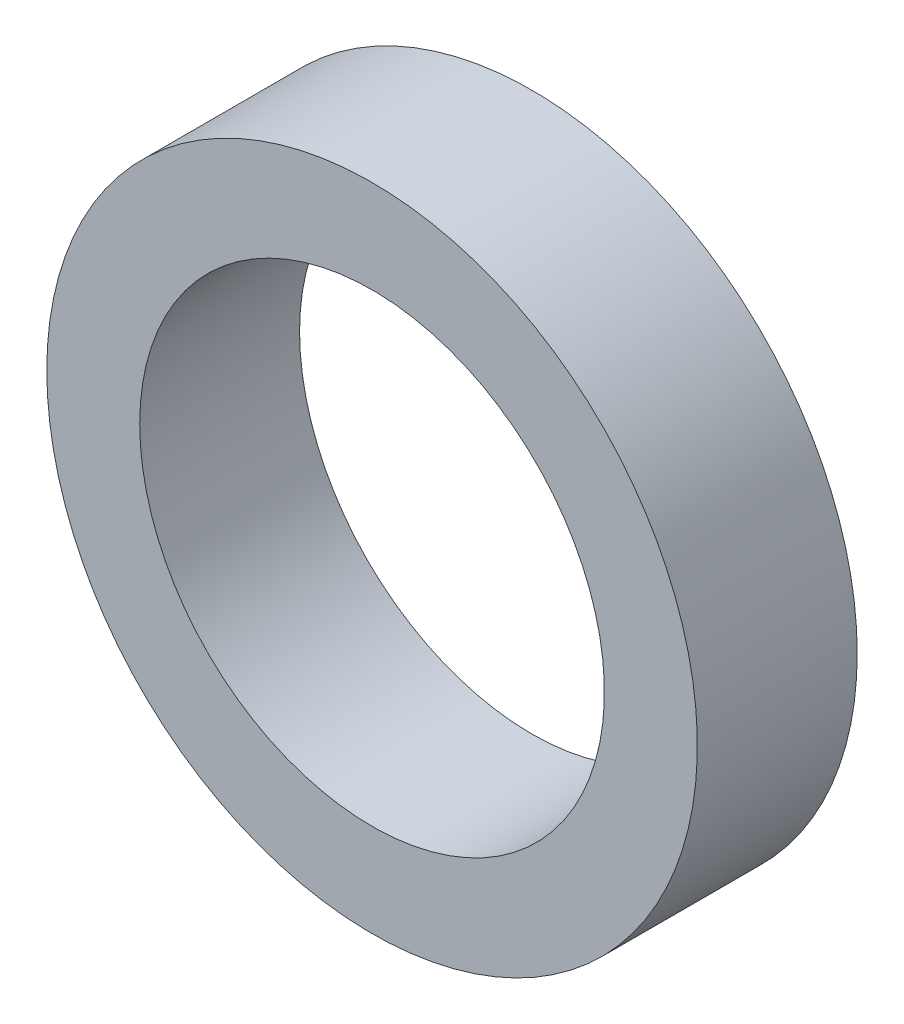
ISO-10303-21;
HEADER;
FILE_DESCRIPTION(('STEP AP214'),'2;1');
FILE_NAME('part.step','',(''),(''),'','','');
FILE_SCHEMA(('AUTOMOTIVE_DESIGN { 1 0 10303 214 1 1 1 1 }'));
ENDSEC;
DATA;
#1=APPLICATION_CONTEXT('core data for automotive mechanical design processes');
#2=APPLICATION_PROTOCOL_DEFINITION('international standard','automotive_design',2000,#1);
#3=PRODUCT_CONTEXT('',#1,'mechanical');
#4=PRODUCT('Part','Part','',(#3));
#5=PRODUCT_RELATED_PRODUCT_CATEGORY('part','',(#4));
#6=PRODUCT_DEFINITION_FORMATION('','',#4);
#7=PRODUCT_DEFINITION_CONTEXT('part definition',#1,'design');
#8=PRODUCT_DEFINITION('design','',#6,#7);
#9=PRODUCT_DEFINITION_SHAPE('','',#8);
#10=(LENGTH_UNIT() NAMED_UNIT(*) SI_UNIT(.MILLI.,.METRE.));
#11=(NAMED_UNIT(*) PLANE_ANGLE_UNIT() SI_UNIT($,.RADIAN.));
#12=(NAMED_UNIT(*) SI_UNIT($,.STERADIAN.) SOLID_ANGLE_UNIT());
#13=UNCERTAINTY_MEASURE_WITH_UNIT(LENGTH_MEASURE(1.E-05),#10,'distance_accuracy_value','');
#14=(GEOMETRIC_REPRESENTATION_CONTEXT(3) GLOBAL_UNCERTAINTY_ASSIGNED_CONTEXT((#13)) GLOBAL_UNIT_ASSIGNED_CONTEXT((#10,
#11,#12)) REPRESENTATION_CONTEXT('',''));
#15=CARTESIAN_POINT('',(0.,0.,0.));
#16=DIRECTION('',(0.,0.,1.));
#17=DIRECTION('',(1.,0.,0.));
#18=AXIS2_PLACEMENT_3D('',#15,#16,#17);
#19=CARTESIAN_POINT('',(0.,-64.9999999999998,0.));
#20=DIRECTION('',(0.,0.,1.));
#21=DIRECTION('',(1.,0.,0.));
#22=AXIS2_PLACEMENT_3D('',#19,#20,#21);
#23=PLANE('',#22);
#24=CARTESIAN_POINT('',(0.,-64.9999999999998,0.));
#25=DIRECTION('',(0.,0.,1.));
#26=DIRECTION('',(1.,0.,0.));
#27=AXIS2_PLACEMENT_3D('',#24,#25,#26);
#28=CIRCLE('',#27,17.5);
#29=CARTESIAN_POINT('',(17.5000000000001,-64.9999999999998,0.));
#30=VERTEX_POINT('',#29);
#31=EDGE_CURVE('E41',#30,#30,#28,.T.);
#32=ORIENTED_EDGE('',*,*,#31,.F.);
#33=EDGE_LOOP('',(#32));
#34=FACE_BOUND('',#33,.T.);
#35=CARTESIAN_POINT('',(0.,-64.9999999999998,0.));
#36=DIRECTION('',(0.,0.,1.));
#37=DIRECTION('',(1.,0.,0.));
#38=AXIS2_PLACEMENT_3D('',#35,#36,#37);
#39=CIRCLE('',#38,12.5);
#40=CARTESIAN_POINT('',(12.5000000000001,-64.9999999999998,0.));
#41=VERTEX_POINT('',#40);
#42=EDGE_CURVE('E50',#41,#41,#39,.T.);
#43=ORIENTED_EDGE('',*,*,#42,.T.);
#44=EDGE_LOOP('',(#43));
#45=FACE_BOUND('',#44,.T.);
#46=ADVANCED_FACE('F34',(#34,#45),#23,.F.);
#47=CARTESIAN_POINT('',(0.,-64.9999999999998,60.0974746830583));
#48=DIRECTION('',(0.,0.,-1.));
#49=DIRECTION('',(-1.,0.,0.));
#50=AXIS2_PLACEMENT_3D('',#47,#48,#49);
#51=CYLINDRICAL_SURFACE('',#50,17.5);
#52=CARTESIAN_POINT('',(0.,-64.9999999999998,8.59999999999993));
#53=DIRECTION('',(0.,0.,-1.));
#54=DIRECTION('',(-1.,0.,0.));
#55=AXIS2_PLACEMENT_3D('',#52,#53,#54);
#56=CIRCLE('',#55,17.5);
#57=CARTESIAN_POINT('',(-17.4999999999999,-64.9999999999998,8.59999999999993));
#58=VERTEX_POINT('',#57);
#59=EDGE_CURVE('E45',#58,#58,#56,.T.);
#60=ORIENTED_EDGE('',*,*,#59,.T.);
#61=EDGE_LOOP('',(#60));
#62=FACE_BOUND('',#61,.T.);
#63=ORIENTED_EDGE('',*,*,#31,.T.);
#64=EDGE_LOOP('',(#63));
#65=FACE_BOUND('',#64,.T.);
#66=ADVANCED_FACE('F58',(#62,#65),#51,.T.);
#67=CARTESIAN_POINT('',(0.,-64.9999999999998,60.0974746830583));
#68=DIRECTION('',(0.,0.,-1.));
#69=DIRECTION('',(-1.,0.,0.));
#70=AXIS2_PLACEMENT_3D('',#67,#68,#69);
#71=CYLINDRICAL_SURFACE('',#70,12.5);
#72=CARTESIAN_POINT('',(0.,-64.9999999999998,8.59999999999993));
#73=DIRECTION('',(0.,0.,-1.));
#74=DIRECTION('',(-1.,0.,0.));
#75=AXIS2_PLACEMENT_3D('',#72,#73,#74);
#76=CIRCLE('',#75,12.5);
#77=CARTESIAN_POINT('',(-12.4999999999999,-64.9999999999998,8.59999999999993));
#78=VERTEX_POINT('',#77);
#79=EDGE_CURVE('E11',#78,#78,#76,.T.);
#80=ORIENTED_EDGE('',*,*,#79,.F.);
#81=EDGE_LOOP('',(#80));
#82=FACE_BOUND('',#81,.T.);
#83=ORIENTED_EDGE('',*,*,#42,.F.);
#84=EDGE_LOOP('',(#83));
#85=FACE_BOUND('',#84,.T.);
#86=ADVANCED_FACE('F56',(#82,#85),#71,.F.);
#87=CARTESIAN_POINT('',(88.7570448422769,-66.1828558428016,8.59999999999993));
#88=DIRECTION('',(0.,0.,-1.));
#89=DIRECTION('',(-0.903164585908277,0.429294456942005,0.));
#90=AXIS2_PLACEMENT_3D('',#87,#88,#89);
#91=PLANE('',#90);
#92=ORIENTED_EDGE('',*,*,#79,.T.);
#93=EDGE_LOOP('',(#92));
#94=FACE_BOUND('',#93,.T.);
#95=ORIENTED_EDGE('',*,*,#59,.F.);
#96=EDGE_LOOP('',(#95));
#97=FACE_BOUND('',#96,.T.);
#98=ADVANCED_FACE('F36',(#94,#97),#91,.F.);
#99=CLOSED_SHELL('',(#46,#66,#86,#98));
#100=MANIFOLD_SOLID_BREP('B2',#99);
#101=ADVANCED_BREP_SHAPE_REPRESENTATION('',(#18,#100),#14);
#102=SHAPE_DEFINITION_REPRESENTATION(#9,#101);
ENDSEC;
END-ISO-10303-21;
